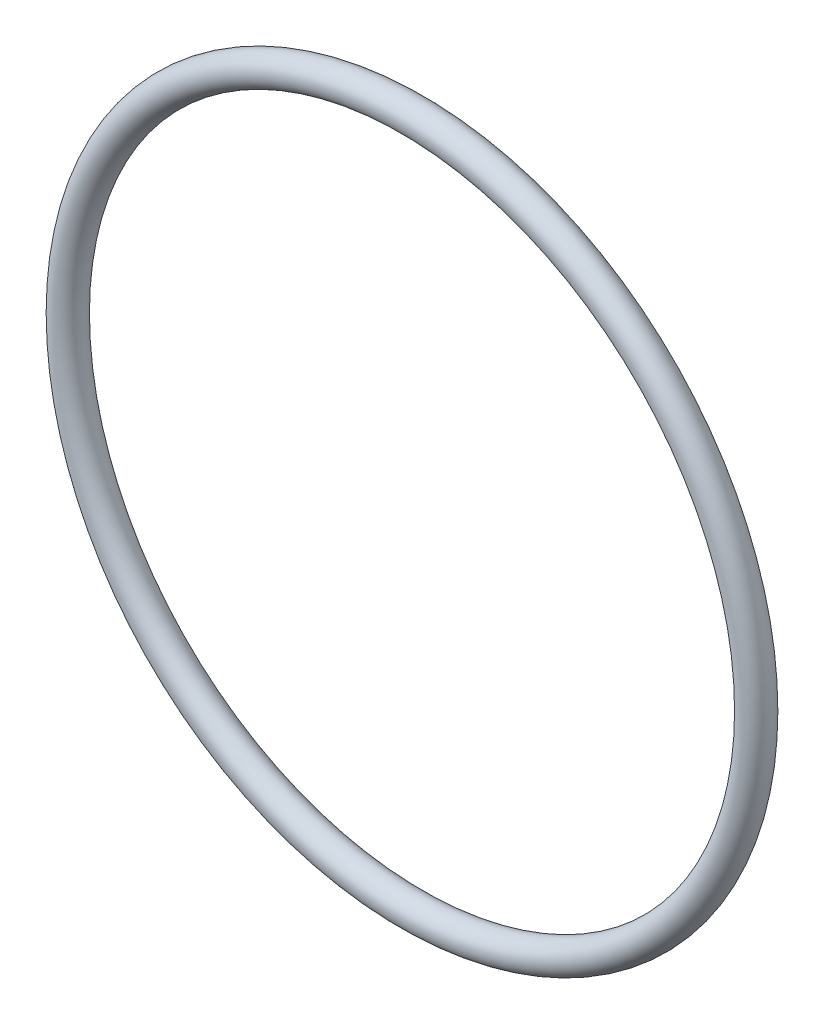
ISO-10303-21;
HEADER;
FILE_DESCRIPTION(('STEP AP214'),'2;1');
FILE_NAME('part.step','',(''),(''),'','','');
FILE_SCHEMA(('AUTOMOTIVE_DESIGN { 1 0 10303 214 1 1 1 1 }'));
ENDSEC;
DATA;
#1=APPLICATION_CONTEXT('core data for automotive mechanical design processes');
#2=APPLICATION_PROTOCOL_DEFINITION('international standard','automotive_design',2000,#1);
#3=PRODUCT_CONTEXT('',#1,'mechanical');
#4=PRODUCT('Part','Part','',(#3));
#5=PRODUCT_RELATED_PRODUCT_CATEGORY('part','',(#4));
#6=PRODUCT_DEFINITION_FORMATION('','',#4);
#7=PRODUCT_DEFINITION_CONTEXT('part definition',#1,'design');
#8=PRODUCT_DEFINITION('design','',#6,#7);
#9=PRODUCT_DEFINITION_SHAPE('','',#8);
#10=(LENGTH_UNIT() NAMED_UNIT(*) SI_UNIT(.MILLI.,.METRE.));
#11=(NAMED_UNIT(*) PLANE_ANGLE_UNIT() SI_UNIT($,.RADIAN.));
#12=(NAMED_UNIT(*) SI_UNIT($,.STERADIAN.) SOLID_ANGLE_UNIT());
#13=UNCERTAINTY_MEASURE_WITH_UNIT(LENGTH_MEASURE(1.E-05),#10,'distance_accuracy_value','');
#14=(GEOMETRIC_REPRESENTATION_CONTEXT(3) GLOBAL_UNCERTAINTY_ASSIGNED_CONTEXT((#13)) GLOBAL_UNIT_ASSIGNED_CONTEXT((#10,
#11,#12)) REPRESENTATION_CONTEXT('',''));
#15=CARTESIAN_POINT('',(0.,0.,0.));
#16=DIRECTION('',(0.,0.,1.));
#17=DIRECTION('',(1.,0.,0.));
#18=AXIS2_PLACEMENT_3D('',#15,#16,#17);
#19=CARTESIAN_POINT('',(0.,0.,0.));
#20=DIRECTION('',(0.,0.,1.));
#21=DIRECTION('',(1.,0.,0.));
#22=AXIS2_PLACEMENT_3D('',#19,#20,#21);
#23=TOROIDAL_SURFACE('',#22,39.6621,1.76530000000001);
#24=CARTESIAN_POINT('',(41.4274,0.,0.));
#25=VERTEX_POINT('',#24);
#26=VERTEX_LOOP('',#25);
#27=FACE_BOUND('',#26,.T.);
#28=ADVANCED_FACE('F32',(#27),#23,.T.);
#29=CLOSED_SHELL('',(#28));
#30=MANIFOLD_SOLID_BREP('B2',#29);
#31=ADVANCED_BREP_SHAPE_REPRESENTATION('',(#18,#30),#14);
#32=SHAPE_DEFINITION_REPRESENTATION(#9,#31);
ENDSEC;
END-ISO-10303-21;
